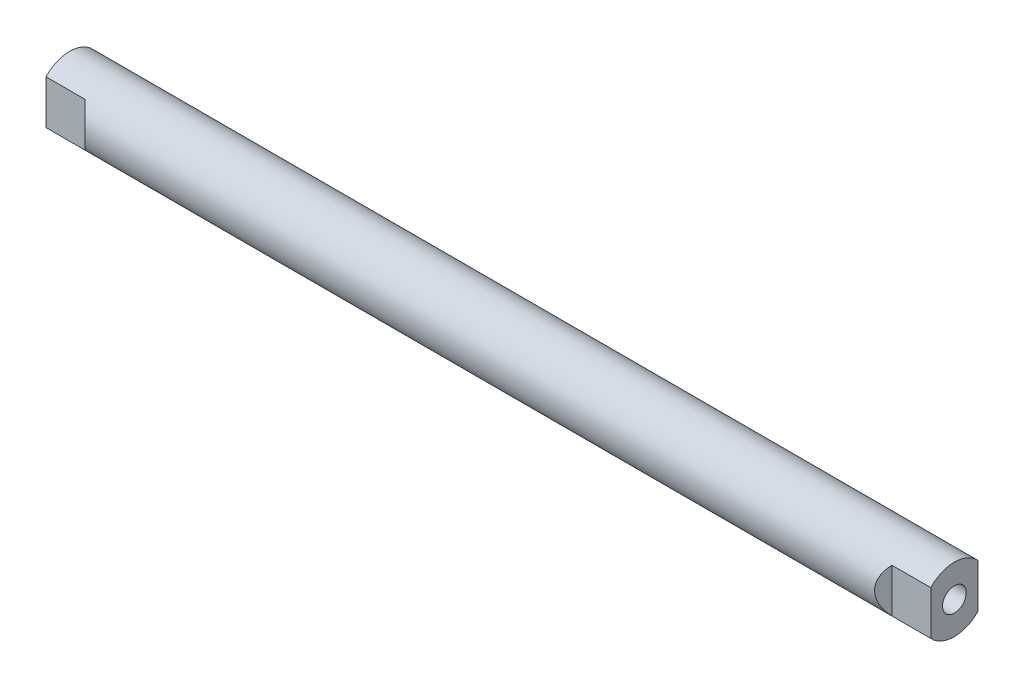
ISO-10303-21;
HEADER;
FILE_DESCRIPTION(('STEP AP214'),'2;1');
FILE_NAME('part.step','',(''),(''),'','','');
FILE_SCHEMA(('AUTOMOTIVE_DESIGN { 1 0 10303 214 1 1 1 1 }'));
ENDSEC;
DATA;
#1=APPLICATION_CONTEXT('core data for automotive mechanical design processes');
#2=APPLICATION_PROTOCOL_DEFINITION('international standard','automotive_design',2000,#1);
#3=PRODUCT_CONTEXT('',#1,'mechanical');
#4=PRODUCT('Part','Part','',(#3));
#5=PRODUCT_RELATED_PRODUCT_CATEGORY('part','',(#4));
#6=PRODUCT_DEFINITION_FORMATION('','',#4);
#7=PRODUCT_DEFINITION_CONTEXT('part definition',#1,'design');
#8=PRODUCT_DEFINITION('design','',#6,#7);
#9=PRODUCT_DEFINITION_SHAPE('','',#8);
#10=(LENGTH_UNIT() NAMED_UNIT(*) SI_UNIT(.MILLI.,.METRE.));
#11=(NAMED_UNIT(*) PLANE_ANGLE_UNIT() SI_UNIT($,.RADIAN.));
#12=(NAMED_UNIT(*) SI_UNIT($,.STERADIAN.) SOLID_ANGLE_UNIT());
#13=UNCERTAINTY_MEASURE_WITH_UNIT(LENGTH_MEASURE(1.E-05),#10,'distance_accuracy_value','');
#14=(GEOMETRIC_REPRESENTATION_CONTEXT(3) GLOBAL_UNCERTAINTY_ASSIGNED_CONTEXT((#13)) GLOBAL_UNIT_ASSIGNED_CONTEXT((#10,
#11,#12)) REPRESENTATION_CONTEXT('',''));
#15=CARTESIAN_POINT('',(0.,0.,0.));
#16=DIRECTION('',(0.,0.,1.));
#17=DIRECTION('',(1.,0.,0.));
#18=AXIS2_PLACEMENT_3D('',#15,#16,#17);
#19=CARTESIAN_POINT('',(148.,10.8,0.));
#20=DIRECTION('',(-1.,0.,0.));
#21=DIRECTION('',(0.,0.,1.));
#22=AXIS2_PLACEMENT_3D('',#19,#20,#21);
#23=PLANE('',#22);
#24=CARTESIAN_POINT('',(148.,0.,0.));
#25=DIRECTION('',(-1.,0.,0.));
#26=DIRECTION('',(0.,0.,1.));
#27=AXIS2_PLACEMENT_3D('',#24,#25,#26);
#28=CIRCLE('',#27,10.8);
#29=CARTESIAN_POINT('',(148.,-7.36410211770583,-7.89999999999999));
#30=VERTEX_POINT('',#29);
#31=CARTESIAN_POINT('',(148.,-7.36410211770579,7.90000000000002));
#32=VERTEX_POINT('',#31);
#33=EDGE_CURVE('E60',#30,#32,#28,.T.);
#34=ORIENTED_EDGE('',*,*,#33,.F.);
#35=DIRECTION('',(0.,1.,0.));
#36=VECTOR('',#35,1.);
#37=CARTESIAN_POINT('',(148.,10.8,-7.89999999999999));
#38=LINE('',#37,#36);
#39=CARTESIAN_POINT('',(148.,7.36410211770583,-7.89999999999999));
#40=VERTEX_POINT('',#39);
#41=EDGE_CURVE('E45',#30,#40,#38,.T.);
#42=ORIENTED_EDGE('',*,*,#41,.T.);
#43=CARTESIAN_POINT('',(148.,7.36410211770579,7.90000000000002));
#44=VERTEX_POINT('',#43);
#45=EDGE_CURVE('E116',#44,#40,#28,.T.);
#46=ORIENTED_EDGE('',*,*,#45,.F.);
#47=DIRECTION('',(0.,-1.,0.));
#48=VECTOR('',#47,1.);
#49=CARTESIAN_POINT('',(148.,10.8,7.90000000000002));
#50=LINE('',#49,#48);
#51=EDGE_CURVE('E161',#44,#32,#50,.T.);
#52=ORIENTED_EDGE('',*,*,#51,.T.);
#53=EDGE_LOOP('',(#34,#42,#46,#52));
#54=FACE_BOUND('',#53,.T.);
#55=CARTESIAN_POINT('',(148.,0.,0.));
#56=DIRECTION('',(-1.,0.,0.));
#57=DIRECTION('',(0.,0.,1.));
#58=AXIS2_PLACEMENT_3D('',#55,#56,#57);
#59=CIRCLE('',#58,3.97);
#60=CARTESIAN_POINT('',(148.,0.,3.97));
#61=VERTEX_POINT('',#60);
#62=EDGE_CURVE('E224',#61,#61,#59,.T.);
#63=ORIENTED_EDGE('',*,*,#62,.T.);
#64=EDGE_LOOP('',(#63));
#65=FACE_BOUND('',#64,.T.);
#66=ADVANCED_FACE('F37',(#54,#65),#23,.F.);
#67=CARTESIAN_POINT('',(-148.,10.8,0.));
#68=DIRECTION('',(1.,0.,0.));
#69=DIRECTION('',(0.,0.,-1.));
#70=AXIS2_PLACEMENT_3D('',#67,#68,#69);
#71=PLANE('',#70);
#72=CARTESIAN_POINT('',(-148.,0.,0.));
#73=DIRECTION('',(-1.,0.,0.));
#74=DIRECTION('',(0.,0.,1.));
#75=AXIS2_PLACEMENT_3D('',#72,#73,#74);
#76=CIRCLE('',#75,10.8);
#77=CARTESIAN_POINT('',(-148.,-7.36410211770583,-7.89999999999998));
#78=VERTEX_POINT('',#77);
#79=CARTESIAN_POINT('',(-148.,-7.36410211770579,7.90000000000002));
#80=VERTEX_POINT('',#79);
#81=EDGE_CURVE('E140',#78,#80,#76,.T.);
#82=ORIENTED_EDGE('',*,*,#81,.T.);
#83=DIRECTION('',(0.,1.,0.));
#84=VECTOR('',#83,1.);
#85=CARTESIAN_POINT('',(-148.,10.8,7.90000000000002));
#86=LINE('',#85,#84);
#87=CARTESIAN_POINT('',(-148.,7.3641021177058,7.90000000000001));
#88=VERTEX_POINT('',#87);
#89=EDGE_CURVE('E129',#80,#88,#86,.T.);
#90=ORIENTED_EDGE('',*,*,#89,.T.);
#91=CARTESIAN_POINT('',(-148.,7.36410211770583,-7.89999999999999));
#92=VERTEX_POINT('',#91);
#93=EDGE_CURVE('E139',#88,#92,#76,.T.);
#94=ORIENTED_EDGE('',*,*,#93,.T.);
#95=DIRECTION('',(0.,-1.,0.));
#96=VECTOR('',#95,1.);
#97=CARTESIAN_POINT('',(-148.,10.8,-7.89999999999999));
#98=LINE('',#97,#96);
#99=EDGE_CURVE('E135',#92,#78,#98,.T.);
#100=ORIENTED_EDGE('',*,*,#99,.T.);
#101=EDGE_LOOP('',(#82,#90,#94,#100));
#102=FACE_BOUND('',#101,.T.);
#103=CARTESIAN_POINT('',(-148.,0.,0.));
#104=DIRECTION('',(1.,0.,0.));
#105=DIRECTION('',(0.,0.,-1.));
#106=AXIS2_PLACEMENT_3D('',#103,#104,#105);
#107=CIRCLE('',#106,3.97);
#108=CARTESIAN_POINT('',(-148.,0.,-3.97));
#109=VERTEX_POINT('',#108);
#110=EDGE_CURVE('E217',#109,#109,#107,.T.);
#111=ORIENTED_EDGE('',*,*,#110,.T.);
#112=EDGE_LOOP('',(#111));
#113=FACE_BOUND('',#112,.T.);
#114=ADVANCED_FACE('F39',(#102,#113),#71,.F.);
#115=CARTESIAN_POINT('',(-180.472392975973,0.,0.));
#116=DIRECTION('',(-1.,0.,0.));
#117=DIRECTION('',(0.,0.,1.));
#118=AXIS2_PLACEMENT_3D('',#115,#116,#117);
#119=CYLINDRICAL_SURFACE('',#118,10.8);
#120=ORIENTED_EDGE('',*,*,#45,.T.);
#121=DIRECTION('',(-1.,0.,0.));
#122=VECTOR('',#121,1.);
#123=CARTESIAN_POINT('',(-180.472392975973,7.36410211770583,-7.89999999999998));
#124=LINE('',#123,#122);
#125=CARTESIAN_POINT('',(135.,7.36410211770583,-7.89999999999999));
#126=VERTEX_POINT('',#125);
#127=EDGE_CURVE('E52',#40,#126,#124,.T.);
#128=ORIENTED_EDGE('',*,*,#127,.T.);
#129=CARTESIAN_POINT('',(142.9,0.,0.));
#130=DIRECTION('',(-0.707106781186549,0.,0.707106781186546));
#131=DIRECTION('',(-0.707106781186546,0.,-0.707106781186549));
#132=AXIS2_PLACEMENT_3D('',#129,#130,#131);
#133=ELLIPSE('',#132,15.2735064736293,10.8);
#134=CARTESIAN_POINT('',(135.,-7.36410211770584,-7.89999999999999));
#135=VERTEX_POINT('',#134);
#136=EDGE_CURVE('E11',#126,#135,#133,.T.);
#137=ORIENTED_EDGE('',*,*,#136,.T.);
#138=DIRECTION('',(-1.,0.,0.));
#139=VECTOR('',#138,1.);
#140=CARTESIAN_POINT('',(-180.472392975973,-7.36410211770583,-7.89999999999998));
#141=LINE('',#140,#139);
#142=EDGE_CURVE('E102',#135,#30,#141,.F.);
#143=ORIENTED_EDGE('',*,*,#142,.T.);
#144=ORIENTED_EDGE('',*,*,#33,.T.);
#145=DIRECTION('',(-1.,0.,0.));
#146=VECTOR('',#145,1.);
#147=CARTESIAN_POINT('',(-180.472392975973,-7.3641021177058,7.90000000000001));
#148=LINE('',#147,#146);
#149=CARTESIAN_POINT('',(135.,-7.36410211770582,7.90000000000002));
#150=VERTEX_POINT('',#149);
#151=EDGE_CURVE('E124',#32,#150,#148,.T.);
#152=ORIENTED_EDGE('',*,*,#151,.T.);
#153=CARTESIAN_POINT('',(142.9,0.,0.));
#154=DIRECTION('',(-0.707106781186549,0.,-0.707106781186546));
#155=DIRECTION('',(-0.707106781186546,0.,0.707106781186549));
#156=AXIS2_PLACEMENT_3D('',#153,#154,#155);
#157=ELLIPSE('',#156,15.2735064736293,10.8);
#158=CARTESIAN_POINT('',(135.,7.36410211770582,7.90000000000002));
#159=VERTEX_POINT('',#158);
#160=EDGE_CURVE('E164',#150,#159,#157,.T.);
#161=ORIENTED_EDGE('',*,*,#160,.T.);
#162=DIRECTION('',(-1.,0.,0.));
#163=VECTOR('',#162,1.);
#164=CARTESIAN_POINT('',(-180.472392975973,7.3641021177058,7.90000000000001));
#165=LINE('',#164,#163);
#166=EDGE_CURVE('E120',#159,#44,#165,.F.);
#167=ORIENTED_EDGE('',*,*,#166,.T.);
#168=EDGE_LOOP('',(#120,#128,#137,#143,#144,#152,#161,#167));
#169=FACE_BOUND('',#168,.T.);
#170=CARTESIAN_POINT('',(-142.9,0.,0.));
#171=DIRECTION('',(0.707106781186549,0.,-0.707106781186546));
#172=DIRECTION('',(-0.707106781186546,0.,-0.707106781186549));
#173=AXIS2_PLACEMENT_3D('',#170,#171,#172);
#174=ELLIPSE('',#173,15.2735064736293,10.8);
#175=CARTESIAN_POINT('',(-135.,7.36410211770579,7.90000000000002));
#176=VERTEX_POINT('',#175);
#177=CARTESIAN_POINT('',(-135.,-7.36410211770579,7.90000000000002));
#178=VERTEX_POINT('',#177);
#179=EDGE_CURVE('E152',#176,#178,#174,.T.);
#180=ORIENTED_EDGE('',*,*,#179,.T.);
#181=DIRECTION('',(-1.,0.,0.));
#182=VECTOR('',#181,1.);
#183=CARTESIAN_POINT('',(-180.472392975973,-7.3641021177058,7.90000000000001));
#184=LINE('',#183,#182);
#185=EDGE_CURVE('E158',#178,#80,#184,.T.);
#186=ORIENTED_EDGE('',*,*,#185,.T.);
#187=ORIENTED_EDGE('',*,*,#81,.F.);
#188=DIRECTION('',(-1.,0.,0.));
#189=VECTOR('',#188,1.);
#190=CARTESIAN_POINT('',(-180.472392975973,-7.36410211770583,-7.89999999999998));
#191=LINE('',#190,#189);
#192=CARTESIAN_POINT('',(-135.,-7.36410211770583,-7.89999999999998));
#193=VERTEX_POINT('',#192);
#194=EDGE_CURVE('E143',#78,#193,#191,.F.);
#195=ORIENTED_EDGE('',*,*,#194,.T.);
#196=CARTESIAN_POINT('',(-142.9,0.,0.));
#197=DIRECTION('',(0.707106781186549,0.,0.707106781186546));
#198=DIRECTION('',(-0.707106781186546,0.,0.707106781186549));
#199=AXIS2_PLACEMENT_3D('',#196,#197,#198);
#200=ELLIPSE('',#199,15.2735064736293,10.8);
#201=CARTESIAN_POINT('',(-135.,7.36410211770582,-7.89999999999999));
#202=VERTEX_POINT('',#201);
#203=EDGE_CURVE('E146',#193,#202,#200,.T.);
#204=ORIENTED_EDGE('',*,*,#203,.T.);
#205=DIRECTION('',(-1.,0.,0.));
#206=VECTOR('',#205,1.);
#207=CARTESIAN_POINT('',(-180.472392975973,7.36410211770583,-7.89999999999998));
#208=LINE('',#207,#206);
#209=EDGE_CURVE('E149',#202,#92,#208,.T.);
#210=ORIENTED_EDGE('',*,*,#209,.T.);
#211=ORIENTED_EDGE('',*,*,#93,.F.);
#212=DIRECTION('',(-1.,0.,0.));
#213=VECTOR('',#212,1.);
#214=CARTESIAN_POINT('',(-180.472392975973,7.3641021177058,7.90000000000001));
#215=LINE('',#214,#213);
#216=EDGE_CURVE('E155',#88,#176,#215,.F.);
#217=ORIENTED_EDGE('',*,*,#216,.T.);
#218=EDGE_LOOP('',(#180,#186,#187,#195,#204,#210,#211,#217));
#219=FACE_BOUND('',#218,.T.);
#220=ADVANCED_FACE('F112',(#169,#219),#119,.T.);
#221=CARTESIAN_POINT('',(-135.,-10.8,-7.89999999999999));
#222=DIRECTION('',(0.707106781186549,0.,0.707106781186546));
#223=DIRECTION('',(0.707106781186546,0.,-0.707106781186549));
#224=AXIS2_PLACEMENT_3D('',#221,#222,#223);
#225=PLANE('',#224);
#226=DIRECTION('',(0.,1.,0.));
#227=VECTOR('',#226,1.);
#228=CARTESIAN_POINT('',(-135.,-10.8,-7.89999999999999));
#229=LINE('',#228,#227);
#230=EDGE_CURVE('E132',#193,#202,#229,.T.);
#231=ORIENTED_EDGE('',*,*,#230,.T.);
#232=ORIENTED_EDGE('',*,*,#203,.F.);
#233=EDGE_LOOP('',(#231,#232));
#234=FACE_BOUND('',#233,.T.);
#235=ADVANCED_FACE('F195',(#234),#225,.F.);
#236=CARTESIAN_POINT('',(-172.805953710172,-10.8,-7.89999999999999));
#237=DIRECTION('',(0.,0.,1.));
#238=DIRECTION('',(1.,0.,0.));
#239=AXIS2_PLACEMENT_3D('',#236,#237,#238);
#240=PLANE('',#239);
#241=ORIENTED_EDGE('',*,*,#230,.F.);
#242=ORIENTED_EDGE('',*,*,#194,.F.);
#243=ORIENTED_EDGE('',*,*,#99,.F.);
#244=ORIENTED_EDGE('',*,*,#209,.F.);
#245=EDGE_LOOP('',(#241,#242,#243,#244));
#246=FACE_BOUND('',#245,.T.);
#247=ADVANCED_FACE('F192',(#246),#240,.F.);
#248=CARTESIAN_POINT('',(-172.805953710172,-10.8,7.90000000000002));
#249=DIRECTION('',(0.,0.,-1.));
#250=DIRECTION('',(-1.,0.,0.));
#251=AXIS2_PLACEMENT_3D('',#248,#249,#250);
#252=PLANE('',#251);
#253=DIRECTION('',(0.,1.,0.));
#254=VECTOR('',#253,1.);
#255=CARTESIAN_POINT('',(-135.,-10.8,7.90000000000002));
#256=LINE('',#255,#254);
#257=EDGE_CURVE('E126',#178,#176,#256,.T.);
#258=ORIENTED_EDGE('',*,*,#257,.T.);
#259=ORIENTED_EDGE('',*,*,#216,.F.);
#260=ORIENTED_EDGE('',*,*,#89,.F.);
#261=ORIENTED_EDGE('',*,*,#185,.F.);
#262=EDGE_LOOP('',(#258,#259,#260,#261));
#263=FACE_BOUND('',#262,.T.);
#264=ADVANCED_FACE('F181',(#263),#252,.F.);
#265=CARTESIAN_POINT('',(-135.,-10.8,7.90000000000002));
#266=DIRECTION('',(0.707106781186549,0.,-0.707106781186546));
#267=DIRECTION('',(-0.707106781186546,0.,-0.707106781186549));
#268=AXIS2_PLACEMENT_3D('',#265,#266,#267);
#269=PLANE('',#268);
#270=ORIENTED_EDGE('',*,*,#257,.F.);
#271=ORIENTED_EDGE('',*,*,#179,.F.);
#272=EDGE_LOOP('',(#270,#271));
#273=FACE_BOUND('',#272,.T.);
#274=ADVANCED_FACE('F174',(#273),#269,.F.);
#275=CARTESIAN_POINT('',(135.,-10.8,7.90000000000002));
#276=DIRECTION('',(-0.707106781186549,0.,-0.707106781186546));
#277=DIRECTION('',(-0.707106781186546,0.,0.707106781186549));
#278=AXIS2_PLACEMENT_3D('',#275,#276,#277);
#279=PLANE('',#278);
#280=DIRECTION('',(0.,1.,0.));
#281=VECTOR('',#280,1.);
#282=CARTESIAN_POINT('',(135.,-10.8,7.90000000000002));
#283=LINE('',#282,#281);
#284=EDGE_CURVE('E117',#150,#159,#283,.T.);
#285=ORIENTED_EDGE('',*,*,#284,.T.);
#286=ORIENTED_EDGE('',*,*,#160,.F.);
#287=EDGE_LOOP('',(#285,#286));
#288=FACE_BOUND('',#287,.T.);
#289=ADVANCED_FACE('F172',(#288),#279,.F.);
#290=CARTESIAN_POINT('',(172.805953710172,-10.8,7.90000000000002));
#291=DIRECTION('',(0.,0.,-1.));
#292=DIRECTION('',(-1.,0.,0.));
#293=AXIS2_PLACEMENT_3D('',#290,#291,#292);
#294=PLANE('',#293);
#295=ORIENTED_EDGE('',*,*,#51,.F.);
#296=ORIENTED_EDGE('',*,*,#166,.F.);
#297=ORIENTED_EDGE('',*,*,#284,.F.);
#298=ORIENTED_EDGE('',*,*,#151,.F.);
#299=EDGE_LOOP('',(#295,#296,#297,#298));
#300=FACE_BOUND('',#299,.T.);
#301=ADVANCED_FACE('F169',(#300),#294,.F.);
#302=CARTESIAN_POINT('',(135.,-10.8,-7.89999999999999));
#303=DIRECTION('',(-0.707106781186549,0.,0.707106781186546));
#304=DIRECTION('',(0.707106781186546,0.,0.707106781186549));
#305=AXIS2_PLACEMENT_3D('',#302,#303,#304);
#306=PLANE('',#305);
#307=DIRECTION('',(0.,1.,0.));
#308=VECTOR('',#307,1.);
#309=CARTESIAN_POINT('',(135.,-10.8,-7.89999999999999));
#310=LINE('',#309,#308);
#311=EDGE_CURVE('E105',#135,#126,#310,.T.);
#312=ORIENTED_EDGE('',*,*,#311,.F.);
#313=ORIENTED_EDGE('',*,*,#136,.F.);
#314=EDGE_LOOP('',(#312,#313));
#315=FACE_BOUND('',#314,.T.);
#316=ADVANCED_FACE('F108',(#315),#306,.F.);
#317=CARTESIAN_POINT('',(172.805953710172,-10.8,-7.89999999999999));
#318=DIRECTION('',(0.,0.,1.));
#319=DIRECTION('',(1.,0.,0.));
#320=AXIS2_PLACEMENT_3D('',#317,#318,#319);
#321=PLANE('',#320);
#322=ORIENTED_EDGE('',*,*,#41,.F.);
#323=ORIENTED_EDGE('',*,*,#142,.F.);
#324=ORIENTED_EDGE('',*,*,#311,.T.);
#325=ORIENTED_EDGE('',*,*,#127,.F.);
#326=EDGE_LOOP('',(#322,#323,#324,#325));
#327=FACE_BOUND('',#326,.T.);
#328=ADVANCED_FACE('F104',(#327),#321,.F.);
#329=CARTESIAN_POINT('',(-117.4,0.,0.));
#330=DIRECTION('',(-1.,0.,0.));
#331=DIRECTION('',(0.,0.,1.));
#332=AXIS2_PLACEMENT_3D('',#329,#330,#331);
#333=CYLINDRICAL_SURFACE('',#332,3.97);
#334=CARTESIAN_POINT('',(-117.4,0.,0.));
#335=DIRECTION('',(1.,0.,0.));
#336=DIRECTION('',(0.,0.,-1.));
#337=AXIS2_PLACEMENT_3D('',#334,#335,#336);
#338=CIRCLE('',#337,3.97);
#339=CARTESIAN_POINT('',(-117.4,0.,-3.97));
#340=VERTEX_POINT('',#339);
#341=EDGE_CURVE('E109',#340,#340,#338,.T.);
#342=ORIENTED_EDGE('',*,*,#341,.T.);
#343=EDGE_LOOP('',(#342));
#344=FACE_BOUND('',#343,.T.);
#345=ORIENTED_EDGE('',*,*,#110,.F.);
#346=EDGE_LOOP('',(#345));
#347=FACE_BOUND('',#346,.T.);
#348=ADVANCED_FACE('F242',(#344,#347),#333,.F.);
#349=CARTESIAN_POINT('',(-117.4,0.,0.));
#350=DIRECTION('',(1.,0.,0.));
#351=DIRECTION('',(0.,0.,-1.));
#352=AXIS2_PLACEMENT_3D('',#349,#350,#351);
#353=PLANE('',#352);
#354=ORIENTED_EDGE('',*,*,#341,.F.);
#355=EDGE_LOOP('',(#354));
#356=FACE_BOUND('',#355,.T.);
#357=ADVANCED_FACE('F233',(#356),#353,.F.);
#358=CARTESIAN_POINT('',(117.4,0.,0.));
#359=DIRECTION('',(1.,0.,0.));
#360=DIRECTION('',(0.,0.,-1.));
#361=AXIS2_PLACEMENT_3D('',#358,#359,#360);
#362=CYLINDRICAL_SURFACE('',#361,3.97);
#363=CARTESIAN_POINT('',(117.4,0.,0.));
#364=DIRECTION('',(-1.,0.,0.));
#365=DIRECTION('',(0.,0.,1.));
#366=AXIS2_PLACEMENT_3D('',#363,#364,#365);
#367=CIRCLE('',#366,3.97);
#368=CARTESIAN_POINT('',(117.4,0.,3.97));
#369=VERTEX_POINT('',#368);
#370=EDGE_CURVE('E219',#369,#369,#367,.T.);
#371=ORIENTED_EDGE('',*,*,#370,.T.);
#372=EDGE_LOOP('',(#371));
#373=FACE_BOUND('',#372,.T.);
#374=ORIENTED_EDGE('',*,*,#62,.F.);
#375=EDGE_LOOP('',(#374));
#376=FACE_BOUND('',#375,.T.);
#377=ADVANCED_FACE('F230',(#373,#376),#362,.F.);
#378=CARTESIAN_POINT('',(117.4,0.,0.));
#379=DIRECTION('',(-1.,0.,0.));
#380=DIRECTION('',(0.,0.,1.));
#381=AXIS2_PLACEMENT_3D('',#378,#379,#380);
#382=PLANE('',#381);
#383=ORIENTED_EDGE('',*,*,#370,.F.);
#384=EDGE_LOOP('',(#383));
#385=FACE_BOUND('',#384,.T.);
#386=ADVANCED_FACE('F232',(#385),#382,.F.);
#387=CLOSED_SHELL('',(#66,#114,#220,#235,#247,#264,#274,#289,#301,#316,#328,#348,#357,#377,#386));
#388=MANIFOLD_SOLID_BREP('B2',#387);
#389=ADVANCED_BREP_SHAPE_REPRESENTATION('',(#18,#388),#14);
#390=SHAPE_DEFINITION_REPRESENTATION(#9,#389);
ENDSEC;
END-ISO-10303-21;
